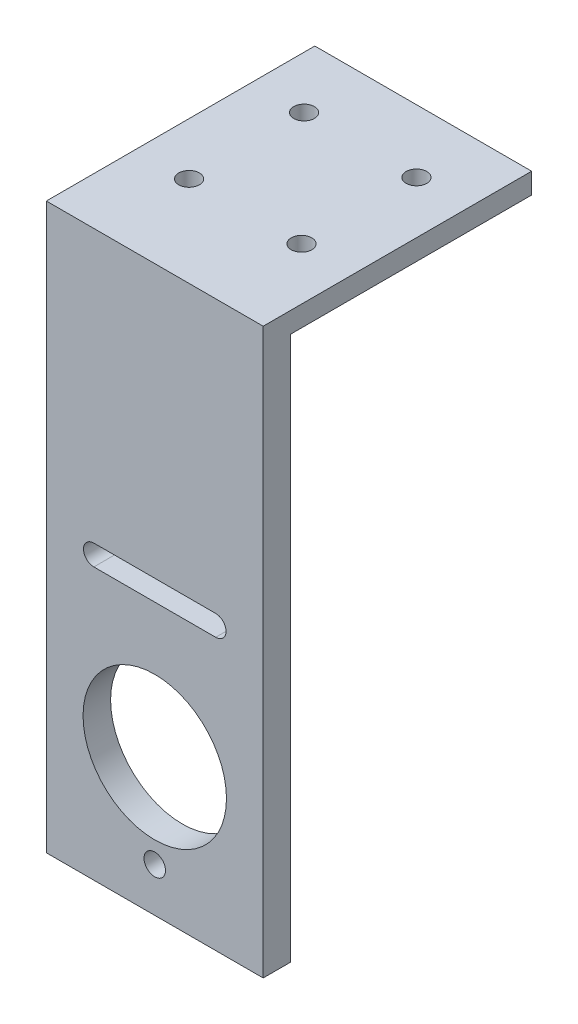
ISO-10303-21;
HEADER;
FILE_DESCRIPTION(('STEP AP214'),'2;1');
FILE_NAME('part.step','',(''),(''),'','','');
FILE_SCHEMA(('AUTOMOTIVE_DESIGN { 1 0 10303 214 1 1 1 1 }'));
ENDSEC;
DATA;
#1=APPLICATION_CONTEXT('core data for automotive mechanical design processes');
#2=APPLICATION_PROTOCOL_DEFINITION('international standard','automotive_design',2000,#1);
#3=PRODUCT_CONTEXT('',#1,'mechanical');
#4=PRODUCT('Part','Part','',(#3));
#5=PRODUCT_RELATED_PRODUCT_CATEGORY('part','',(#4));
#6=PRODUCT_DEFINITION_FORMATION('','',#4);
#7=PRODUCT_DEFINITION_CONTEXT('part definition',#1,'design');
#8=PRODUCT_DEFINITION('design','',#6,#7);
#9=PRODUCT_DEFINITION_SHAPE('','',#8);
#10=(LENGTH_UNIT() NAMED_UNIT(*) SI_UNIT(.MILLI.,.METRE.));
#11=(NAMED_UNIT(*) PLANE_ANGLE_UNIT() SI_UNIT($,.RADIAN.));
#12=(NAMED_UNIT(*) SI_UNIT($,.STERADIAN.) SOLID_ANGLE_UNIT());
#13=UNCERTAINTY_MEASURE_WITH_UNIT(LENGTH_MEASURE(1.E-05),#10,'distance_accuracy_value','');
#14=(GEOMETRIC_REPRESENTATION_CONTEXT(3) GLOBAL_UNCERTAINTY_ASSIGNED_CONTEXT((#13)) GLOBAL_UNIT_ASSIGNED_CONTEXT((#10,
#11,#12)) REPRESENTATION_CONTEXT('',''));
#15=CARTESIAN_POINT('',(0.,0.,0.));
#16=DIRECTION('',(0.,0.,1.));
#17=DIRECTION('',(1.,0.,0.));
#18=AXIS2_PLACEMENT_3D('',#15,#16,#17);
#19=CARTESIAN_POINT('',(0.,0.,0.));
#20=DIRECTION('',(0.,0.,1.));
#21=DIRECTION('',(1.,0.,0.));
#22=AXIS2_PLACEMENT_3D('',#19,#20,#21);
#23=PLANE('',#22);
#24=CARTESIAN_POINT('',(0.,-6.70833333333333,0.));
#25=DIRECTION('',(0.,0.,1.));
#26=DIRECTION('',(1.,0.,0.));
#27=AXIS2_PLACEMENT_3D('',#24,#25,#26);
#28=CIRCLE('',#27,10.4175243347668);
#29=CARTESIAN_POINT('',(10.4175243347668,-6.70833333333333,0.));
#30=VERTEX_POINT('',#29);
#31=EDGE_CURVE('E174',#30,#30,#28,.T.);
#32=ORIENTED_EDGE('',*,*,#31,.T.);
#33=EDGE_LOOP('',(#32));
#34=FACE_BOUND('',#33,.T.);
#35=CARTESIAN_POINT('',(8.85,14.2916666666667,0.));
#36=DIRECTION('',(0.,0.,1.));
#37=DIRECTION('',(1.,0.,0.));
#38=AXIS2_PLACEMENT_3D('',#35,#36,#37);
#39=CIRCLE('',#38,1.5);
#40=CARTESIAN_POINT('',(8.85,12.7916666666667,0.));
#41=VERTEX_POINT('',#40);
#42=CARTESIAN_POINT('',(8.85,15.7916666666667,0.));
#43=VERTEX_POINT('',#42);
#44=EDGE_CURVE('E157',#41,#43,#39,.T.);
#45=ORIENTED_EDGE('',*,*,#44,.T.);
#46=DIRECTION('',(-1.,0.,0.));
#47=VECTOR('',#46,1.);
#48=CARTESIAN_POINT('',(0.,15.7916666666667,0.));
#49=LINE('',#48,#47);
#50=CARTESIAN_POINT('',(-8.85,15.7916666666667,0.));
#51=VERTEX_POINT('',#50);
#52=EDGE_CURVE('E170',#43,#51,#49,.T.);
#53=ORIENTED_EDGE('',*,*,#52,.T.);
#54=CARTESIAN_POINT('',(-8.85,14.2916666666667,0.));
#55=DIRECTION('',(0.,0.,1.));
#56=DIRECTION('',(1.,0.,0.));
#57=AXIS2_PLACEMENT_3D('',#54,#55,#56);
#58=CIRCLE('',#57,1.5);
#59=CARTESIAN_POINT('',(-8.85,12.7916666666667,0.));
#60=VERTEX_POINT('',#59);
#61=EDGE_CURVE('E166',#51,#60,#58,.T.);
#62=ORIENTED_EDGE('',*,*,#61,.T.);
#63=DIRECTION('',(-1.,0.,0.));
#64=VECTOR('',#63,1.);
#65=CARTESIAN_POINT('',(0.,12.7916666666667,0.));
#66=LINE('',#65,#64);
#67=EDGE_CURVE('E162',#41,#60,#66,.T.);
#68=ORIENTED_EDGE('',*,*,#67,.F.);
#69=EDGE_LOOP('',(#45,#53,#62,#68));
#70=FACE_BOUND('',#69,.T.);
#71=CARTESIAN_POINT('',(-2.70616862252382E-13,-20.2083333333333,0.));
#72=DIRECTION('',(0.,0.,1.));
#73=DIRECTION('',(1.,0.,0.));
#74=AXIS2_PLACEMENT_3D('',#71,#72,#73);
#75=CIRCLE('',#74,1.56);
#76=CARTESIAN_POINT('',(1.55999999999973,-20.2083333333333,0.));
#77=VERTEX_POINT('',#76);
#78=EDGE_CURVE('E153',#77,#77,#75,.T.);
#79=ORIENTED_EDGE('',*,*,#78,.T.);
#80=EDGE_LOOP('',(#79));
#81=FACE_BOUND('',#80,.T.);
#82=DIRECTION('',(-1.,0.,0.));
#83=VECTOR('',#82,1.);
#84=CARTESIAN_POINT('',(15.7504319540038,52.3770786942291,0.));
#85=LINE('',#84,#83);
#86=CARTESIAN_POINT('',(15.7504319540038,52.3770786942291,0.));
#87=VERTEX_POINT('',#86);
#88=CARTESIAN_POINT('',(-15.7504319540038,52.3770786942291,0.));
#89=VERTEX_POINT('',#88);
#90=EDGE_CURVE('E59',#87,#89,#85,.T.);
#91=ORIENTED_EDGE('',*,*,#90,.F.);
#92=DIRECTION('',(0.,-1.,0.));
#93=VECTOR('',#92,1.);
#94=CARTESIAN_POINT('',(15.7504319540038,0.,0.));
#95=LINE('',#94,#93);
#96=CARTESIAN_POINT('',(15.7504319540038,-26.6229213057709,0.));
#97=VERTEX_POINT('',#96);
#98=EDGE_CURVE('E182',#87,#97,#95,.T.);
#99=ORIENTED_EDGE('',*,*,#98,.T.);
#100=DIRECTION('',(-1.,0.,0.));
#101=VECTOR('',#100,1.);
#102=CARTESIAN_POINT('',(0.,-26.6229213057709,0.));
#103=LINE('',#102,#101);
#104=CARTESIAN_POINT('',(-15.7504319540044,-26.6229213057709,0.));
#105=VERTEX_POINT('',#104);
#106=EDGE_CURVE('E178',#97,#105,#103,.T.);
#107=ORIENTED_EDGE('',*,*,#106,.T.);
#108=DIRECTION('',(0.,-1.,0.));
#109=VECTOR('',#108,1.);
#110=CARTESIAN_POINT('',(-15.7504319540044,0.,0.));
#111=LINE('',#110,#109);
#112=EDGE_CURVE('E93',#89,#105,#111,.T.);
#113=ORIENTED_EDGE('',*,*,#112,.F.);
#114=EDGE_LOOP('',(#91,#99,#107,#113));
#115=FACE_BOUND('',#114,.T.);
#116=ADVANCED_FACE('F41',(#34,#70,#81,#115),#23,.F.);
#117=CARTESIAN_POINT('',(0.,-26.6229213057709,4.));
#118=DIRECTION('',(0.,-1.,0.));
#119=DIRECTION('',(0.,0.,-1.));
#120=AXIS2_PLACEMENT_3D('',#117,#118,#119);
#121=PLANE('',#120);
#122=ORIENTED_EDGE('',*,*,#106,.F.);
#123=DIRECTION('',(0.,0.,-1.));
#124=VECTOR('',#123,1.);
#125=CARTESIAN_POINT('',(15.7504319540038,-26.6229213057709,4.));
#126=LINE('',#125,#124);
#127=CARTESIAN_POINT('',(15.7504319540038,-26.6229213057709,4.));
#128=VERTEX_POINT('',#127);
#129=EDGE_CURVE('E11',#128,#97,#126,.T.);
#130=ORIENTED_EDGE('',*,*,#129,.F.);
#131=DIRECTION('',(-1.,0.,0.));
#132=VECTOR('',#131,1.);
#133=CARTESIAN_POINT('',(0.,-26.6229213057709,4.));
#134=LINE('',#133,#132);
#135=CARTESIAN_POINT('',(-15.7504319540044,-26.6229213057709,4.));
#136=VERTEX_POINT('',#135);
#137=EDGE_CURVE('E142',#128,#136,#134,.T.);
#138=ORIENTED_EDGE('',*,*,#137,.T.);
#139=DIRECTION('',(0.,0.,-1.));
#140=VECTOR('',#139,1.);
#141=CARTESIAN_POINT('',(-15.7504319540044,-26.6229213057709,4.));
#142=LINE('',#141,#140);
#143=EDGE_CURVE('E188',#136,#105,#142,.T.);
#144=ORIENTED_EDGE('',*,*,#143,.T.);
#145=EDGE_LOOP('',(#122,#130,#138,#144));
#146=FACE_BOUND('',#145,.T.);
#147=ADVANCED_FACE('F233',(#146),#121,.T.);
#148=CARTESIAN_POINT('',(15.7504319540038,0.,4.));
#149=DIRECTION('',(1.,0.,0.));
#150=DIRECTION('',(0.,1.,0.));
#151=AXIS2_PLACEMENT_3D('',#148,#149,#150);
#152=PLANE('',#151);
#153=ORIENTED_EDGE('',*,*,#98,.F.);
#154=DIRECTION('',(0.,0.,1.));
#155=VECTOR('',#154,1.);
#156=CARTESIAN_POINT('',(15.7504319540038,52.3770786942291,-35.));
#157=LINE('',#156,#155);
#158=CARTESIAN_POINT('',(15.7504319540038,52.3770786942291,-35.));
#159=VERTEX_POINT('',#158);
#160=EDGE_CURVE('E158',#159,#87,#157,.T.);
#161=ORIENTED_EDGE('',*,*,#160,.F.);
#162=DIRECTION('',(0.,-1.,0.));
#163=VECTOR('',#162,1.);
#164=CARTESIAN_POINT('',(15.7504319540038,52.3770786942291,-35.));
#165=LINE('',#164,#163);
#166=CARTESIAN_POINT('',(15.7504319540038,55.3770786942291,-35.));
#167=VERTEX_POINT('',#166);
#168=EDGE_CURVE('E127',#167,#159,#165,.T.);
#169=ORIENTED_EDGE('',*,*,#168,.F.);
#170=DIRECTION('',(0.,0.,-1.));
#171=VECTOR('',#170,1.);
#172=CARTESIAN_POINT('',(15.7504319540038,55.3770786942291,4.));
#173=LINE('',#172,#171);
#174=CARTESIAN_POINT('',(15.7504319540038,55.3770786942291,4.));
#175=VERTEX_POINT('',#174);
#176=EDGE_CURVE('E51',#175,#167,#173,.T.);
#177=ORIENTED_EDGE('',*,*,#176,.F.);
#178=DIRECTION('',(0.,-1.,0.));
#179=VECTOR('',#178,1.);
#180=CARTESIAN_POINT('',(15.7504319540038,0.,4.));
#181=LINE('',#180,#179);
#182=EDGE_CURVE('E124',#175,#128,#181,.T.);
#183=ORIENTED_EDGE('',*,*,#182,.T.);
#184=ORIENTED_EDGE('',*,*,#129,.T.);
#185=EDGE_LOOP('',(#153,#161,#169,#177,#183,#184));
#186=FACE_BOUND('',#185,.T.);
#187=ADVANCED_FACE('F122',(#186),#152,.T.);
#188=CARTESIAN_POINT('',(0.,55.3770786942291,4.));
#189=DIRECTION('',(0.,-1.,0.));
#190=DIRECTION('',(1.,0.,0.));
#191=AXIS2_PLACEMENT_3D('',#188,#189,#190);
#192=PLANE('',#191);
#193=CARTESIAN_POINT('',(-8.16643624629268,55.3770786942291,-25.8487455979238));
#194=DIRECTION('',(0.,-1.,0.));
#195=DIRECTION('',(0.,0.,1.));
#196=AXIS2_PLACEMENT_3D('',#193,#194,#195);
#197=CIRCLE('',#196,1.5);
#198=CARTESIAN_POINT('',(-8.16643624629268,55.3770786942291,-24.3487455979238));
#199=VERTEX_POINT('',#198);
#200=EDGE_CURVE('E336',#199,#199,#197,.T.);
#201=ORIENTED_EDGE('',*,*,#200,.T.);
#202=EDGE_LOOP('',(#201));
#203=FACE_BOUND('',#202,.T.);
#204=CARTESIAN_POINT('',(8.16643624629268,55.3770786942291,-25.8487455979238));
#205=DIRECTION('',(0.,-1.,0.));
#206=DIRECTION('',(0.,0.,-1.));
#207=AXIS2_PLACEMENT_3D('',#204,#205,#206);
#208=CIRCLE('',#207,1.5);
#209=CARTESIAN_POINT('',(8.16643624629268,55.3770786942291,-27.3487455979238));
#210=VERTEX_POINT('',#209);
#211=EDGE_CURVE('E323',#210,#210,#208,.T.);
#212=ORIENTED_EDGE('',*,*,#211,.T.);
#213=EDGE_LOOP('',(#212));
#214=FACE_BOUND('',#213,.T.);
#215=CARTESIAN_POINT('',(8.16643624629268,55.3770786942291,-9.15125440207617));
#216=DIRECTION('',(0.,-1.,0.));
#217=DIRECTION('',(0.,0.,1.));
#218=AXIS2_PLACEMENT_3D('',#215,#216,#217);
#219=CIRCLE('',#218,1.5);
#220=CARTESIAN_POINT('',(8.16643624629268,55.3770786942291,-7.65125440207617));
#221=VERTEX_POINT('',#220);
#222=EDGE_CURVE('E317',#221,#221,#219,.T.);
#223=ORIENTED_EDGE('',*,*,#222,.T.);
#224=EDGE_LOOP('',(#223));
#225=FACE_BOUND('',#224,.T.);
#226=CARTESIAN_POINT('',(-8.16643624629268,55.3770786942291,-9.15125440207617));
#227=DIRECTION('',(0.,-1.,0.));
#228=DIRECTION('',(0.,0.,-1.));
#229=AXIS2_PLACEMENT_3D('',#226,#227,#228);
#230=CIRCLE('',#229,1.5);
#231=CARTESIAN_POINT('',(-8.16643624629268,55.3770786942291,-10.6512544020762));
#232=VERTEX_POINT('',#231);
#233=EDGE_CURVE('E344',#232,#232,#230,.T.);
#234=ORIENTED_EDGE('',*,*,#233,.T.);
#235=EDGE_LOOP('',(#234));
#236=FACE_BOUND('',#235,.T.);
#237=ORIENTED_EDGE('',*,*,#176,.T.);
#238=DIRECTION('',(1.,0.,0.));
#239=VECTOR('',#238,1.);
#240=CARTESIAN_POINT('',(15.7504319540038,55.3770786942291,-35.));
#241=LINE('',#240,#239);
#242=CARTESIAN_POINT('',(-15.7504319540044,55.3770786942291,-35.));
#243=VERTEX_POINT('',#242);
#244=EDGE_CURVE('E361',#243,#167,#241,.T.);
#245=ORIENTED_EDGE('',*,*,#244,.F.);
#246=DIRECTION('',(0.,0.,-1.));
#247=VECTOR('',#246,1.);
#248=CARTESIAN_POINT('',(-15.7504319540044,55.3770786942291,4.));
#249=LINE('',#248,#247);
#250=CARTESIAN_POINT('',(-15.7504319540044,55.3770786942291,4.));
#251=VERTEX_POINT('',#250);
#252=EDGE_CURVE('E132',#251,#243,#249,.T.);
#253=ORIENTED_EDGE('',*,*,#252,.F.);
#254=DIRECTION('',(-1.,0.,0.));
#255=VECTOR('',#254,1.);
#256=CARTESIAN_POINT('',(0.,55.3770786942291,4.));
#257=LINE('',#256,#255);
#258=EDGE_CURVE('E135',#175,#251,#257,.T.);
#259=ORIENTED_EDGE('',*,*,#258,.F.);
#260=EDGE_LOOP('',(#237,#245,#253,#259));
#261=FACE_BOUND('',#260,.T.);
#262=ADVANCED_FACE('F136',(#203,#214,#225,#236,#261),#192,.F.);
#263=CARTESIAN_POINT('',(8.85,14.2916666666667,4.));
#264=DIRECTION('',(0.,0.,-1.));
#265=DIRECTION('',(-1.,0.,0.));
#266=AXIS2_PLACEMENT_3D('',#263,#264,#265);
#267=CYLINDRICAL_SURFACE('',#266,1.5);
#268=ORIENTED_EDGE('',*,*,#44,.F.);
#269=DIRECTION('',(0.,0.,-1.));
#270=VECTOR('',#269,1.);
#271=CARTESIAN_POINT('',(8.85,12.7916666666667,4.));
#272=LINE('',#271,#270);
#273=CARTESIAN_POINT('',(8.85,12.7916666666667,4.));
#274=VERTEX_POINT('',#273);
#275=EDGE_CURVE('E45',#274,#41,#272,.T.);
#276=ORIENTED_EDGE('',*,*,#275,.F.);
#277=CARTESIAN_POINT('',(8.85,14.2916666666667,4.));
#278=DIRECTION('',(0.,0.,1.));
#279=DIRECTION('',(1.,0.,0.));
#280=AXIS2_PLACEMENT_3D('',#277,#278,#279);
#281=CIRCLE('',#280,1.5);
#282=CARTESIAN_POINT('',(8.85,15.7916666666667,4.));
#283=VERTEX_POINT('',#282);
#284=EDGE_CURVE('E213',#274,#283,#281,.T.);
#285=ORIENTED_EDGE('',*,*,#284,.T.);
#286=DIRECTION('',(0.,0.,-1.));
#287=VECTOR('',#286,1.);
#288=CARTESIAN_POINT('',(8.85,15.7916666666667,4.));
#289=LINE('',#288,#287);
#290=EDGE_CURVE('E152',#283,#43,#289,.T.);
#291=ORIENTED_EDGE('',*,*,#290,.T.);
#292=EDGE_LOOP('',(#268,#276,#285,#291));
#293=FACE_BOUND('',#292,.T.);
#294=ADVANCED_FACE('F212',(#293),#267,.F.);
#295=CARTESIAN_POINT('',(0.,12.7916666666667,4.));
#296=DIRECTION('',(0.,-1.,0.));
#297=DIRECTION('',(1.,0.,0.));
#298=AXIS2_PLACEMENT_3D('',#295,#296,#297);
#299=PLANE('',#298);
#300=ORIENTED_EDGE('',*,*,#67,.T.);
#301=DIRECTION('',(0.,0.,-1.));
#302=VECTOR('',#301,1.);
#303=CARTESIAN_POINT('',(-8.85,12.7916666666667,4.));
#304=LINE('',#303,#302);
#305=CARTESIAN_POINT('',(-8.85,12.7916666666667,4.));
#306=VERTEX_POINT('',#305);
#307=EDGE_CURVE('E197',#306,#60,#304,.T.);
#308=ORIENTED_EDGE('',*,*,#307,.F.);
#309=DIRECTION('',(-1.,0.,0.));
#310=VECTOR('',#309,1.);
#311=CARTESIAN_POINT('',(0.,12.7916666666667,4.));
#312=LINE('',#311,#310);
#313=EDGE_CURVE('E207',#274,#306,#312,.T.);
#314=ORIENTED_EDGE('',*,*,#313,.F.);
#315=ORIENTED_EDGE('',*,*,#275,.T.);
#316=EDGE_LOOP('',(#300,#308,#314,#315));
#317=FACE_BOUND('',#316,.T.);
#318=ADVANCED_FACE('F206',(#317),#299,.F.);
#319=CARTESIAN_POINT('',(-8.85,14.2916666666667,4.));
#320=DIRECTION('',(0.,0.,-1.));
#321=DIRECTION('',(-1.,0.,0.));
#322=AXIS2_PLACEMENT_3D('',#319,#320,#321);
#323=CYLINDRICAL_SURFACE('',#322,1.5);
#324=ORIENTED_EDGE('',*,*,#61,.F.);
#325=DIRECTION('',(0.,0.,-1.));
#326=VECTOR('',#325,1.);
#327=CARTESIAN_POINT('',(-8.85,15.7916666666667,4.));
#328=LINE('',#327,#326);
#329=CARTESIAN_POINT('',(-8.85,15.7916666666667,4.));
#330=VERTEX_POINT('',#329);
#331=EDGE_CURVE('E195',#330,#51,#328,.T.);
#332=ORIENTED_EDGE('',*,*,#331,.F.);
#333=CARTESIAN_POINT('',(-8.85,14.2916666666667,4.));
#334=DIRECTION('',(0.,0.,1.));
#335=DIRECTION('',(1.,0.,0.));
#336=AXIS2_PLACEMENT_3D('',#333,#334,#335);
#337=CIRCLE('',#336,1.5);
#338=EDGE_CURVE('E272',#330,#306,#337,.T.);
#339=ORIENTED_EDGE('',*,*,#338,.T.);
#340=ORIENTED_EDGE('',*,*,#307,.T.);
#341=EDGE_LOOP('',(#324,#332,#339,#340));
#342=FACE_BOUND('',#341,.T.);
#343=ADVANCED_FACE('F220',(#342),#323,.F.);
#344=CARTESIAN_POINT('',(0.,-6.70833333333333,4.));
#345=DIRECTION('',(0.,0.,-1.));
#346=DIRECTION('',(-1.,0.,0.));
#347=AXIS2_PLACEMENT_3D('',#344,#345,#346);
#348=CYLINDRICAL_SURFACE('',#347,10.4175243347668);
#349=CARTESIAN_POINT('',(0.,-6.70833333333333,4.));
#350=DIRECTION('',(0.,0.,1.));
#351=DIRECTION('',(1.,0.,0.));
#352=AXIS2_PLACEMENT_3D('',#349,#350,#351);
#353=CIRCLE('',#352,10.4175243347668);
#354=CARTESIAN_POINT('',(10.4175243347668,-6.70833333333333,4.));
#355=VERTEX_POINT('',#354);
#356=EDGE_CURVE('E146',#355,#355,#353,.T.);
#357=ORIENTED_EDGE('',*,*,#356,.T.);
#358=EDGE_LOOP('',(#357));
#359=FACE_BOUND('',#358,.T.);
#360=ORIENTED_EDGE('',*,*,#31,.F.);
#361=EDGE_LOOP('',(#360));
#362=FACE_BOUND('',#361,.T.);
#363=ADVANCED_FACE('F222',(#359,#362),#348,.F.);
#364=CARTESIAN_POINT('',(0.,15.7916666666667,4.));
#365=DIRECTION('',(0.,-1.,0.));
#366=DIRECTION('',(1.,0.,0.));
#367=AXIS2_PLACEMENT_3D('',#364,#365,#366);
#368=PLANE('',#367);
#369=ORIENTED_EDGE('',*,*,#52,.F.);
#370=ORIENTED_EDGE('',*,*,#290,.F.);
#371=DIRECTION('',(-1.,0.,0.));
#372=VECTOR('',#371,1.);
#373=CARTESIAN_POINT('',(0.,15.7916666666667,4.));
#374=LINE('',#373,#372);
#375=EDGE_CURVE('E218',#283,#330,#374,.T.);
#376=ORIENTED_EDGE('',*,*,#375,.T.);
#377=ORIENTED_EDGE('',*,*,#331,.T.);
#378=EDGE_LOOP('',(#369,#370,#376,#377));
#379=FACE_BOUND('',#378,.T.);
#380=ADVANCED_FACE('F217',(#379),#368,.T.);
#381=CARTESIAN_POINT('',(-2.70616862252382E-13,-20.2083333333333,4.));
#382=DIRECTION('',(0.,0.,-1.));
#383=DIRECTION('',(-1.,0.,0.));
#384=AXIS2_PLACEMENT_3D('',#381,#382,#383);
#385=CYLINDRICAL_SURFACE('',#384,1.56);
#386=CARTESIAN_POINT('',(-2.70616862252382E-13,-20.2083333333333,4.));
#387=DIRECTION('',(0.,0.,1.));
#388=DIRECTION('',(1.,0.,0.));
#389=AXIS2_PLACEMENT_3D('',#386,#387,#388);
#390=CIRCLE('',#389,1.56);
#391=CARTESIAN_POINT('',(1.55999999999973,-20.2083333333333,4.));
#392=VERTEX_POINT('',#391);
#393=EDGE_CURVE('E187',#392,#392,#390,.T.);
#394=ORIENTED_EDGE('',*,*,#393,.T.);
#395=EDGE_LOOP('',(#394));
#396=FACE_BOUND('',#395,.T.);
#397=ORIENTED_EDGE('',*,*,#78,.F.);
#398=EDGE_LOOP('',(#397));
#399=FACE_BOUND('',#398,.T.);
#400=ADVANCED_FACE('F43',(#396,#399),#385,.F.);
#401=CARTESIAN_POINT('',(-15.7504319540044,0.,4.));
#402=DIRECTION('',(1.,0.,0.));
#403=DIRECTION('',(0.,0.,-1.));
#404=AXIS2_PLACEMENT_3D('',#401,#402,#403);
#405=PLANE('',#404);
#406=ORIENTED_EDGE('',*,*,#252,.T.);
#407=DIRECTION('',(-1.83880688453542E-13,1.,0.));
#408=VECTOR('',#407,1.);
#409=CARTESIAN_POINT('',(-15.7504319540038,52.3770786942291,-35.));
#410=LINE('',#409,#408);
#411=CARTESIAN_POINT('',(-15.7504319540038,52.3770786942291,-35.));
#412=VERTEX_POINT('',#411);
#413=EDGE_CURVE('E357',#412,#243,#410,.T.);
#414=ORIENTED_EDGE('',*,*,#413,.F.);
#415=DIRECTION('',(0.,0.,1.));
#416=VECTOR('',#415,1.);
#417=CARTESIAN_POINT('',(-15.7504319540038,52.3770786942291,-35.));
#418=LINE('',#417,#416);
#419=EDGE_CURVE('E364',#412,#89,#418,.T.);
#420=ORIENTED_EDGE('',*,*,#419,.T.);
#421=ORIENTED_EDGE('',*,*,#112,.T.);
#422=ORIENTED_EDGE('',*,*,#143,.F.);
#423=DIRECTION('',(0.,-1.,0.));
#424=VECTOR('',#423,1.);
#425=CARTESIAN_POINT('',(-15.7504319540044,0.,4.));
#426=LINE('',#425,#424);
#427=EDGE_CURVE('E68',#251,#136,#426,.T.);
#428=ORIENTED_EDGE('',*,*,#427,.F.);
#429=EDGE_LOOP('',(#406,#414,#420,#421,#422,#428));
#430=FACE_BOUND('',#429,.T.);
#431=ADVANCED_FACE('F244',(#430),#405,.F.);
#432=CARTESIAN_POINT('',(0.,0.,4.));
#433=DIRECTION('',(0.,0.,1.));
#434=DIRECTION('',(1.,0.,0.));
#435=AXIS2_PLACEMENT_3D('',#432,#433,#434);
#436=PLANE('',#435);
#437=ORIENTED_EDGE('',*,*,#393,.F.);
#438=EDGE_LOOP('',(#437));
#439=FACE_BOUND('',#438,.T.);
#440=ORIENTED_EDGE('',*,*,#284,.F.);
#441=ORIENTED_EDGE('',*,*,#313,.T.);
#442=ORIENTED_EDGE('',*,*,#338,.F.);
#443=ORIENTED_EDGE('',*,*,#375,.F.);
#444=EDGE_LOOP('',(#440,#441,#442,#443));
#445=FACE_BOUND('',#444,.T.);
#446=ORIENTED_EDGE('',*,*,#356,.F.);
#447=EDGE_LOOP('',(#446));
#448=FACE_BOUND('',#447,.T.);
#449=ORIENTED_EDGE('',*,*,#137,.F.);
#450=ORIENTED_EDGE('',*,*,#182,.F.);
#451=ORIENTED_EDGE('',*,*,#258,.T.);
#452=ORIENTED_EDGE('',*,*,#427,.T.);
#453=EDGE_LOOP('',(#449,#450,#451,#452));
#454=FACE_BOUND('',#453,.T.);
#455=ADVANCED_FACE('F140',(#439,#445,#448,#454),#436,.T.);
#456=CARTESIAN_POINT('',(15.7504319540038,52.3770786942291,-35.));
#457=DIRECTION('',(0.,1.,0.));
#458=DIRECTION('',(0.,0.,1.));
#459=AXIS2_PLACEMENT_3D('',#456,#457,#458);
#460=PLANE('',#459);
#461=CARTESIAN_POINT('',(-8.16643624629268,52.3770786942291,-25.8487455979238));
#462=DIRECTION('',(0.,-1.,0.));
#463=DIRECTION('',(0.,0.,1.));
#464=AXIS2_PLACEMENT_3D('',#461,#462,#463);
#465=CIRCLE('',#464,1.5);
#466=CARTESIAN_POINT('',(-8.16643624629268,52.3770786942291,-24.3487455979238));
#467=VERTEX_POINT('',#466);
#468=EDGE_CURVE('E340',#467,#467,#465,.T.);
#469=ORIENTED_EDGE('',*,*,#468,.F.);
#470=EDGE_LOOP('',(#469));
#471=FACE_BOUND('',#470,.T.);
#472=CARTESIAN_POINT('',(8.16643624629268,52.3770786942291,-25.8487455979238));
#473=DIRECTION('',(0.,-1.,0.));
#474=DIRECTION('',(0.,0.,-1.));
#475=AXIS2_PLACEMENT_3D('',#472,#473,#474);
#476=CIRCLE('',#475,1.5);
#477=CARTESIAN_POINT('',(8.16643624629268,52.3770786942291,-27.3487455979238));
#478=VERTEX_POINT('',#477);
#479=EDGE_CURVE('E330',#478,#478,#476,.T.);
#480=ORIENTED_EDGE('',*,*,#479,.F.);
#481=EDGE_LOOP('',(#480));
#482=FACE_BOUND('',#481,.T.);
#483=CARTESIAN_POINT('',(8.16643624629268,52.3770786942291,-9.15125440207617));
#484=DIRECTION('',(0.,-1.,0.));
#485=DIRECTION('',(0.,0.,1.));
#486=AXIS2_PLACEMENT_3D('',#483,#484,#485);
#487=CIRCLE('',#486,1.5);
#488=CARTESIAN_POINT('',(8.16643624629268,52.3770786942291,-7.65125440207617));
#489=VERTEX_POINT('',#488);
#490=EDGE_CURVE('E320',#489,#489,#487,.T.);
#491=ORIENTED_EDGE('',*,*,#490,.F.);
#492=EDGE_LOOP('',(#491));
#493=FACE_BOUND('',#492,.T.);
#494=CARTESIAN_POINT('',(-8.16643624629268,52.3770786942291,-9.15125440207617));
#495=DIRECTION('',(0.,-1.,0.));
#496=DIRECTION('',(0.,0.,-1.));
#497=AXIS2_PLACEMENT_3D('',#494,#495,#496);
#498=CIRCLE('',#497,1.5);
#499=CARTESIAN_POINT('',(-8.16643624629268,52.3770786942291,-10.6512544020762));
#500=VERTEX_POINT('',#499);
#501=EDGE_CURVE('E327',#500,#500,#498,.T.);
#502=ORIENTED_EDGE('',*,*,#501,.F.);
#503=EDGE_LOOP('',(#502));
#504=FACE_BOUND('',#503,.T.);
#505=ORIENTED_EDGE('',*,*,#90,.T.);
#506=ORIENTED_EDGE('',*,*,#419,.F.);
#507=DIRECTION('',(-1.,0.,0.));
#508=VECTOR('',#507,1.);
#509=CARTESIAN_POINT('',(15.7504319540038,52.3770786942291,-35.));
#510=LINE('',#509,#508);
#511=EDGE_CURVE('E353',#159,#412,#510,.T.);
#512=ORIENTED_EDGE('',*,*,#511,.F.);
#513=ORIENTED_EDGE('',*,*,#160,.T.);
#514=EDGE_LOOP('',(#505,#506,#512,#513));
#515=FACE_BOUND('',#514,.T.);
#516=ADVANCED_FACE('F282',(#471,#482,#493,#504,#515),#460,.F.);
#517=CARTESIAN_POINT('',(0.,0.,-35.));
#518=DIRECTION('',(0.,0.,1.));
#519=DIRECTION('',(1.,0.,0.));
#520=AXIS2_PLACEMENT_3D('',#517,#518,#519);
#521=PLANE('',#520);
#522=ORIENTED_EDGE('',*,*,#168,.T.);
#523=ORIENTED_EDGE('',*,*,#511,.T.);
#524=ORIENTED_EDGE('',*,*,#413,.T.);
#525=ORIENTED_EDGE('',*,*,#244,.T.);
#526=EDGE_LOOP('',(#522,#523,#524,#525));
#527=FACE_BOUND('',#526,.T.);
#528=ADVANCED_FACE('F286',(#527),#521,.F.);
#529=CARTESIAN_POINT('',(-8.16643624629268,55.3770786942291,-9.15125440207617));
#530=DIRECTION('',(0.,-1.,0.));
#531=DIRECTION('',(0.,0.,-1.));
#532=AXIS2_PLACEMENT_3D('',#529,#530,#531);
#533=CYLINDRICAL_SURFACE('',#532,1.5);
#534=ORIENTED_EDGE('',*,*,#233,.F.);
#535=EDGE_LOOP('',(#534));
#536=FACE_BOUND('',#535,.T.);
#537=ORIENTED_EDGE('',*,*,#501,.T.);
#538=EDGE_LOOP('',(#537));
#539=FACE_BOUND('',#538,.T.);
#540=ADVANCED_FACE('F292',(#536,#539),#533,.F.);
#541=CARTESIAN_POINT('',(8.16643624629268,55.3770786942291,-9.15125440207617));
#542=DIRECTION('',(0.,-1.,0.));
#543=DIRECTION('',(0.,0.,-1.));
#544=AXIS2_PLACEMENT_3D('',#541,#542,#543);
#545=CYLINDRICAL_SURFACE('',#544,1.5);
#546=ORIENTED_EDGE('',*,*,#222,.F.);
#547=EDGE_LOOP('',(#546));
#548=FACE_BOUND('',#547,.T.);
#549=ORIENTED_EDGE('',*,*,#490,.T.);
#550=EDGE_LOOP('',(#549));
#551=FACE_BOUND('',#550,.T.);
#552=ADVANCED_FACE('F300',(#548,#551),#545,.F.);
#553=CARTESIAN_POINT('',(8.16643624629268,55.3770786942291,-25.8487455979238));
#554=DIRECTION('',(0.,-1.,0.));
#555=DIRECTION('',(0.,0.,-1.));
#556=AXIS2_PLACEMENT_3D('',#553,#554,#555);
#557=CYLINDRICAL_SURFACE('',#556,1.5);
#558=ORIENTED_EDGE('',*,*,#211,.F.);
#559=EDGE_LOOP('',(#558));
#560=FACE_BOUND('',#559,.T.);
#561=ORIENTED_EDGE('',*,*,#479,.T.);
#562=EDGE_LOOP('',(#561));
#563=FACE_BOUND('',#562,.T.);
#564=ADVANCED_FACE('F305',(#560,#563),#557,.F.);
#565=CARTESIAN_POINT('',(-8.16643624629268,55.3770786942291,-25.8487455979238));
#566=DIRECTION('',(0.,-1.,0.));
#567=DIRECTION('',(0.,0.,-1.));
#568=AXIS2_PLACEMENT_3D('',#565,#566,#567);
#569=CYLINDRICAL_SURFACE('',#568,1.5);
#570=ORIENTED_EDGE('',*,*,#200,.F.);
#571=EDGE_LOOP('',(#570));
#572=FACE_BOUND('',#571,.T.);
#573=ORIENTED_EDGE('',*,*,#468,.T.);
#574=EDGE_LOOP('',(#573));
#575=FACE_BOUND('',#574,.T.);
#576=ADVANCED_FACE('F302',(#572,#575),#569,.F.);
#577=CLOSED_SHELL('',(#116,#147,#187,#262,#294,#318,#343,#363,#380,#400,#431,#455,#516,#528,
#540,#552,#564,#576));
#578=MANIFOLD_SOLID_BREP('B2',#577);
#579=ADVANCED_BREP_SHAPE_REPRESENTATION('',(#18,#578),#14);
#580=SHAPE_DEFINITION_REPRESENTATION(#9,#579);
ENDSEC;
END-ISO-10303-21;
